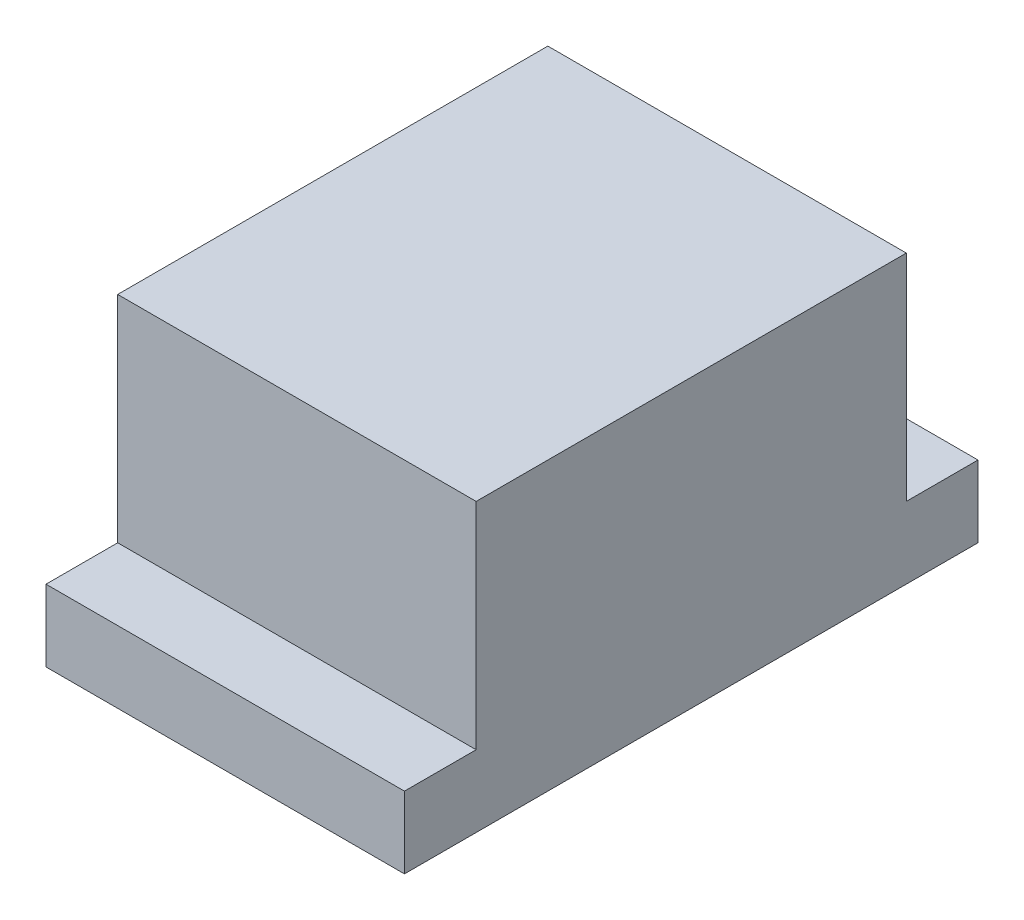
ISO-10303-21;
HEADER;
FILE_DESCRIPTION(('STEP AP214'),'2;1');
FILE_NAME('part.step','',(''),(''),'','','');
FILE_SCHEMA(('AUTOMOTIVE_DESIGN { 1 0 10303 214 1 1 1 1 }'));
ENDSEC;
DATA;
#1=APPLICATION_CONTEXT('core data for automotive mechanical design processes');
#2=APPLICATION_PROTOCOL_DEFINITION('international standard','automotive_design',2000,#1);
#3=PRODUCT_CONTEXT('',#1,'mechanical');
#4=PRODUCT('Part','Part','',(#3));
#5=PRODUCT_RELATED_PRODUCT_CATEGORY('part','',(#4));
#6=PRODUCT_DEFINITION_FORMATION('','',#4);
#7=PRODUCT_DEFINITION_CONTEXT('part definition',#1,'design');
#8=PRODUCT_DEFINITION('design','',#6,#7);
#9=PRODUCT_DEFINITION_SHAPE('','',#8);
#10=(LENGTH_UNIT() NAMED_UNIT(*) SI_UNIT(.MILLI.,.METRE.));
#11=(NAMED_UNIT(*) PLANE_ANGLE_UNIT() SI_UNIT($,.RADIAN.));
#12=(NAMED_UNIT(*) SI_UNIT($,.STERADIAN.) SOLID_ANGLE_UNIT());
#13=UNCERTAINTY_MEASURE_WITH_UNIT(LENGTH_MEASURE(1.E-05),#10,'distance_accuracy_value','');
#14=(GEOMETRIC_REPRESENTATION_CONTEXT(3) GLOBAL_UNCERTAINTY_ASSIGNED_CONTEXT((#13)) GLOBAL_UNIT_ASSIGNED_CONTEXT((#10,
#11,#12)) REPRESENTATION_CONTEXT('',''));
#15=CARTESIAN_POINT('',(0.,0.,0.));
#16=DIRECTION('',(0.,0.,1.));
#17=DIRECTION('',(1.,0.,0.));
#18=AXIS2_PLACEMENT_3D('',#15,#16,#17);
#19=CARTESIAN_POINT('',(50.,40.,30.));
#20=DIRECTION('',(0.,0.,-1.));
#21=DIRECTION('',(0.,1.,0.));
#22=AXIS2_PLACEMENT_3D('',#19,#20,#21);
#23=PLANE('',#22);
#24=DIRECTION('',(0.,-1.,0.));
#25=VECTOR('',#24,1.);
#26=CARTESIAN_POINT('',(0.,40.,30.));
#27=LINE('',#26,#25);
#28=CARTESIAN_POINT('',(0.,40.,30.));
#29=VERTEX_POINT('',#28);
#30=CARTESIAN_POINT('',(0.,9.99999999999999,30.));
#31=VERTEX_POINT('',#30);
#32=EDGE_CURVE('E129',#29,#31,#27,.T.);
#33=ORIENTED_EDGE('',*,*,#32,.T.);
#34=DIRECTION('',(-1.,0.,0.));
#35=VECTOR('',#34,1.);
#36=CARTESIAN_POINT('',(50.,9.99999999999999,30.));
#37=LINE('',#36,#35);
#38=CARTESIAN_POINT('',(50.,9.99999999999999,30.));
#39=VERTEX_POINT('',#38);
#40=EDGE_CURVE('E11',#39,#31,#37,.T.);
#41=ORIENTED_EDGE('',*,*,#40,.F.);
#42=DIRECTION('',(0.,-1.,0.));
#43=VECTOR('',#42,1.);
#44=CARTESIAN_POINT('',(50.,40.,30.));
#45=LINE('',#44,#43);
#46=CARTESIAN_POINT('',(50.,40.,30.));
#47=VERTEX_POINT('',#46);
#48=EDGE_CURVE('E143',#47,#39,#45,.T.);
#49=ORIENTED_EDGE('',*,*,#48,.F.);
#50=DIRECTION('',(-1.,0.,0.));
#51=VECTOR('',#50,1.);
#52=CARTESIAN_POINT('',(50.,40.,30.));
#53=LINE('',#52,#51);
#54=EDGE_CURVE('E125',#47,#29,#53,.T.);
#55=ORIENTED_EDGE('',*,*,#54,.T.);
#56=EDGE_LOOP('',(#33,#41,#49,#55));
#57=FACE_BOUND('',#56,.T.);
#58=ADVANCED_FACE('F33',(#57),#23,.F.);
#59=CARTESIAN_POINT('',(50.,9.99999999999999,30.));
#60=DIRECTION('',(0.,-1.,0.));
#61=DIRECTION('',(0.,0.,-1.));
#62=AXIS2_PLACEMENT_3D('',#59,#60,#61);
#63=PLANE('',#62);
#64=DIRECTION('',(0.,0.,1.));
#65=VECTOR('',#64,1.);
#66=CARTESIAN_POINT('',(0.,9.99999999999999,30.));
#67=LINE('',#66,#65);
#68=CARTESIAN_POINT('',(0.,9.99999999999999,40.));
#69=VERTEX_POINT('',#68);
#70=EDGE_CURVE('E132',#31,#69,#67,.T.);
#71=ORIENTED_EDGE('',*,*,#70,.T.);
#72=DIRECTION('',(-1.,0.,0.));
#73=VECTOR('',#72,1.);
#74=CARTESIAN_POINT('',(50.,9.99999999999999,40.));
#75=LINE('',#74,#73);
#76=CARTESIAN_POINT('',(50.,9.99999999999999,40.));
#77=VERTEX_POINT('',#76);
#78=EDGE_CURVE('E41',#77,#69,#75,.T.);
#79=ORIENTED_EDGE('',*,*,#78,.F.);
#80=DIRECTION('',(0.,0.,1.));
#81=VECTOR('',#80,1.);
#82=CARTESIAN_POINT('',(50.,9.99999999999999,30.));
#83=LINE('',#82,#81);
#84=EDGE_CURVE('E92',#39,#77,#83,.T.);
#85=ORIENTED_EDGE('',*,*,#84,.F.);
#86=ORIENTED_EDGE('',*,*,#40,.T.);
#87=EDGE_LOOP('',(#71,#79,#85,#86));
#88=FACE_BOUND('',#87,.T.);
#89=ADVANCED_FACE('F178',(#88),#63,.F.);
#90=CARTESIAN_POINT('',(50.,9.99999999999999,40.));
#91=DIRECTION('',(0.,0.,-1.));
#92=DIRECTION('',(-1.,0.,0.));
#93=AXIS2_PLACEMENT_3D('',#90,#91,#92);
#94=PLANE('',#93);
#95=DIRECTION('',(0.,-1.,0.));
#96=VECTOR('',#95,1.);
#97=CARTESIAN_POINT('',(0.,9.99999999999999,40.));
#98=LINE('',#97,#96);
#99=CARTESIAN_POINT('',(0.,0.,40.));
#100=VERTEX_POINT('',#99);
#101=EDGE_CURVE('E134',#69,#100,#98,.T.);
#102=ORIENTED_EDGE('',*,*,#101,.T.);
#103=DIRECTION('',(-1.,0.,0.));
#104=VECTOR('',#103,1.);
#105=CARTESIAN_POINT('',(50.,0.,40.));
#106=LINE('',#105,#104);
#107=CARTESIAN_POINT('',(50.,0.,40.));
#108=VERTEX_POINT('',#107);
#109=EDGE_CURVE('E150',#108,#100,#106,.T.);
#110=ORIENTED_EDGE('',*,*,#109,.F.);
#111=DIRECTION('',(0.,-1.,0.));
#112=VECTOR('',#111,1.);
#113=CARTESIAN_POINT('',(50.,9.99999999999999,40.));
#114=LINE('',#113,#112);
#115=EDGE_CURVE('E158',#77,#108,#114,.T.);
#116=ORIENTED_EDGE('',*,*,#115,.F.);
#117=ORIENTED_EDGE('',*,*,#78,.T.);
#118=EDGE_LOOP('',(#102,#110,#116,#117));
#119=FACE_BOUND('',#118,.T.);
#120=ADVANCED_FACE('F156',(#119),#94,.F.);
#121=CARTESIAN_POINT('',(50.,0.,-40.));
#122=DIRECTION('',(0.,1.,0.));
#123=DIRECTION('',(0.,0.,1.));
#124=AXIS2_PLACEMENT_3D('',#121,#122,#123);
#125=PLANE('',#124);
#126=DIRECTION('',(0.,0.,-1.));
#127=VECTOR('',#126,1.);
#128=CARTESIAN_POINT('',(0.,0.,-40.));
#129=LINE('',#128,#127);
#130=CARTESIAN_POINT('',(0.,0.,-40.));
#131=VERTEX_POINT('',#130);
#132=EDGE_CURVE('E136',#100,#131,#129,.T.);
#133=ORIENTED_EDGE('',*,*,#132,.T.);
#134=DIRECTION('',(-1.,0.,0.));
#135=VECTOR('',#134,1.);
#136=CARTESIAN_POINT('',(50.,0.,-40.));
#137=LINE('',#136,#135);
#138=CARTESIAN_POINT('',(50.,0.,-40.));
#139=VERTEX_POINT('',#138);
#140=EDGE_CURVE('E147',#139,#131,#137,.T.);
#141=ORIENTED_EDGE('',*,*,#140,.F.);
#142=DIRECTION('',(0.,0.,-1.));
#143=VECTOR('',#142,1.);
#144=CARTESIAN_POINT('',(50.,0.,-40.));
#145=LINE('',#144,#143);
#146=EDGE_CURVE('E170',#108,#139,#145,.T.);
#147=ORIENTED_EDGE('',*,*,#146,.F.);
#148=ORIENTED_EDGE('',*,*,#109,.T.);
#149=EDGE_LOOP('',(#133,#141,#147,#148));
#150=FACE_BOUND('',#149,.T.);
#151=ADVANCED_FACE('F166',(#150),#125,.F.);
#152=CARTESIAN_POINT('',(50.,10.,-40.));
#153=DIRECTION('',(0.,0.,1.));
#154=DIRECTION('',(1.,0.,0.));
#155=AXIS2_PLACEMENT_3D('',#152,#153,#154);
#156=PLANE('',#155);
#157=DIRECTION('',(0.,1.,0.));
#158=VECTOR('',#157,1.);
#159=CARTESIAN_POINT('',(0.,10.,-40.));
#160=LINE('',#159,#158);
#161=CARTESIAN_POINT('',(0.,10.,-40.));
#162=VERTEX_POINT('',#161);
#163=EDGE_CURVE('E138',#131,#162,#160,.T.);
#164=ORIENTED_EDGE('',*,*,#163,.T.);
#165=DIRECTION('',(-1.,0.,0.));
#166=VECTOR('',#165,1.);
#167=CARTESIAN_POINT('',(50.,10.,-40.));
#168=LINE('',#167,#166);
#169=CARTESIAN_POINT('',(50.,10.,-40.));
#170=VERTEX_POINT('',#169);
#171=EDGE_CURVE('E120',#170,#162,#168,.T.);
#172=ORIENTED_EDGE('',*,*,#171,.F.);
#173=DIRECTION('',(0.,1.,0.));
#174=VECTOR('',#173,1.);
#175=CARTESIAN_POINT('',(50.,10.,-40.));
#176=LINE('',#175,#174);
#177=EDGE_CURVE('E111',#139,#170,#176,.T.);
#178=ORIENTED_EDGE('',*,*,#177,.F.);
#179=ORIENTED_EDGE('',*,*,#140,.T.);
#180=EDGE_LOOP('',(#164,#172,#178,#179));
#181=FACE_BOUND('',#180,.T.);
#182=ADVANCED_FACE('F169',(#181),#156,.F.);
#183=CARTESIAN_POINT('',(50.,10.,-30.));
#184=DIRECTION('',(0.,-1.,0.));
#185=DIRECTION('',(0.,0.,-1.));
#186=AXIS2_PLACEMENT_3D('',#183,#184,#185);
#187=PLANE('',#186);
#188=DIRECTION('',(0.,0.,1.));
#189=VECTOR('',#188,1.);
#190=CARTESIAN_POINT('',(0.,10.,-30.));
#191=LINE('',#190,#189);
#192=CARTESIAN_POINT('',(0.,10.,-30.));
#193=VERTEX_POINT('',#192);
#194=EDGE_CURVE('E119',#162,#193,#191,.T.);
#195=ORIENTED_EDGE('',*,*,#194,.T.);
#196=DIRECTION('',(-1.,0.,0.));
#197=VECTOR('',#196,1.);
#198=CARTESIAN_POINT('',(50.,10.,-30.));
#199=LINE('',#198,#197);
#200=CARTESIAN_POINT('',(50.,10.,-30.));
#201=VERTEX_POINT('',#200);
#202=EDGE_CURVE('E116',#201,#193,#199,.T.);
#203=ORIENTED_EDGE('',*,*,#202,.F.);
#204=DIRECTION('',(0.,0.,1.));
#205=VECTOR('',#204,1.);
#206=CARTESIAN_POINT('',(50.,10.,-30.));
#207=LINE('',#206,#205);
#208=EDGE_CURVE('E105',#170,#201,#207,.T.);
#209=ORIENTED_EDGE('',*,*,#208,.F.);
#210=ORIENTED_EDGE('',*,*,#171,.T.);
#211=EDGE_LOOP('',(#195,#203,#209,#210));
#212=FACE_BOUND('',#211,.T.);
#213=ADVANCED_FACE('F117',(#212),#187,.F.);
#214=CARTESIAN_POINT('',(50.,40.,-30.));
#215=DIRECTION('',(0.,0.,1.));
#216=DIRECTION('',(0.,-1.,0.));
#217=AXIS2_PLACEMENT_3D('',#214,#215,#216);
#218=PLANE('',#217);
#219=DIRECTION('',(0.,1.,0.));
#220=VECTOR('',#219,1.);
#221=CARTESIAN_POINT('',(0.,40.,-30.));
#222=LINE('',#221,#220);
#223=CARTESIAN_POINT('',(0.,40.,-30.));
#224=VERTEX_POINT('',#223);
#225=EDGE_CURVE('E78',#193,#224,#222,.T.);
#226=ORIENTED_EDGE('',*,*,#225,.T.);
#227=DIRECTION('',(-1.,0.,0.));
#228=VECTOR('',#227,1.);
#229=CARTESIAN_POINT('',(50.,40.,-30.));
#230=LINE('',#229,#228);
#231=CARTESIAN_POINT('',(50.,40.,-30.));
#232=VERTEX_POINT('',#231);
#233=EDGE_CURVE('E121',#232,#224,#230,.T.);
#234=ORIENTED_EDGE('',*,*,#233,.F.);
#235=DIRECTION('',(0.,1.,0.));
#236=VECTOR('',#235,1.);
#237=CARTESIAN_POINT('',(50.,40.,-30.));
#238=LINE('',#237,#236);
#239=EDGE_CURVE('E109',#201,#232,#238,.T.);
#240=ORIENTED_EDGE('',*,*,#239,.F.);
#241=ORIENTED_EDGE('',*,*,#202,.T.);
#242=EDGE_LOOP('',(#226,#234,#240,#241));
#243=FACE_BOUND('',#242,.T.);
#244=ADVANCED_FACE('F123',(#243),#218,.F.);
#245=CARTESIAN_POINT('',(50.,40.,30.));
#246=DIRECTION('',(0.,-1.,0.));
#247=DIRECTION('',(0.,0.,-1.));
#248=AXIS2_PLACEMENT_3D('',#245,#246,#247);
#249=PLANE('',#248);
#250=DIRECTION('',(0.,0.,1.));
#251=VECTOR('',#250,1.);
#252=CARTESIAN_POINT('',(0.,40.,30.));
#253=LINE('',#252,#251);
#254=EDGE_CURVE('E84',#224,#29,#253,.T.);
#255=ORIENTED_EDGE('',*,*,#254,.T.);
#256=ORIENTED_EDGE('',*,*,#54,.F.);
#257=DIRECTION('',(0.,0.,1.));
#258=VECTOR('',#257,1.);
#259=CARTESIAN_POINT('',(50.,40.,30.));
#260=LINE('',#259,#258);
#261=EDGE_CURVE('E49',#232,#47,#260,.T.);
#262=ORIENTED_EDGE('',*,*,#261,.F.);
#263=ORIENTED_EDGE('',*,*,#233,.T.);
#264=EDGE_LOOP('',(#255,#256,#262,#263));
#265=FACE_BOUND('',#264,.T.);
#266=ADVANCED_FACE('F194',(#265),#249,.F.);
#267=CARTESIAN_POINT('',(50.,0.,0.));
#268=DIRECTION('',(-1.,0.,0.));
#269=DIRECTION('',(0.,0.,1.));
#270=AXIS2_PLACEMENT_3D('',#267,#268,#269);
#271=PLANE('',#270);
#272=ORIENTED_EDGE('',*,*,#48,.T.);
#273=ORIENTED_EDGE('',*,*,#84,.T.);
#274=ORIENTED_EDGE('',*,*,#115,.T.);
#275=ORIENTED_EDGE('',*,*,#146,.T.);
#276=ORIENTED_EDGE('',*,*,#177,.T.);
#277=ORIENTED_EDGE('',*,*,#208,.T.);
#278=ORIENTED_EDGE('',*,*,#239,.T.);
#279=ORIENTED_EDGE('',*,*,#261,.T.);
#280=EDGE_LOOP('',(#272,#273,#274,#275,#276,#277,#278,#279));
#281=FACE_BOUND('',#280,.T.);
#282=ADVANCED_FACE('F107',(#281),#271,.F.);
#283=CARTESIAN_POINT('',(0.,0.,0.));
#284=DIRECTION('',(-1.,0.,0.));
#285=DIRECTION('',(0.,0.,1.));
#286=AXIS2_PLACEMENT_3D('',#283,#284,#285);
#287=PLANE('',#286);
#288=ORIENTED_EDGE('',*,*,#32,.F.);
#289=ORIENTED_EDGE('',*,*,#254,.F.);
#290=ORIENTED_EDGE('',*,*,#225,.F.);
#291=ORIENTED_EDGE('',*,*,#194,.F.);
#292=ORIENTED_EDGE('',*,*,#163,.F.);
#293=ORIENTED_EDGE('',*,*,#132,.F.);
#294=ORIENTED_EDGE('',*,*,#101,.F.);
#295=ORIENTED_EDGE('',*,*,#70,.F.);
#296=EDGE_LOOP('',(#288,#289,#290,#291,#292,#293,#294,#295));
#297=FACE_BOUND('',#296,.T.);
#298=ADVANCED_FACE('F162',(#297),#287,.T.);
#299=CLOSED_SHELL('',(#58,#89,#120,#151,#182,#213,#244,#266,#282,#298));
#300=MANIFOLD_SOLID_BREP('B2',#299);
#301=ADVANCED_BREP_SHAPE_REPRESENTATION('',(#18,#300),#14);
#302=SHAPE_DEFINITION_REPRESENTATION(#9,#301);
ENDSEC;
END-ISO-10303-21;
